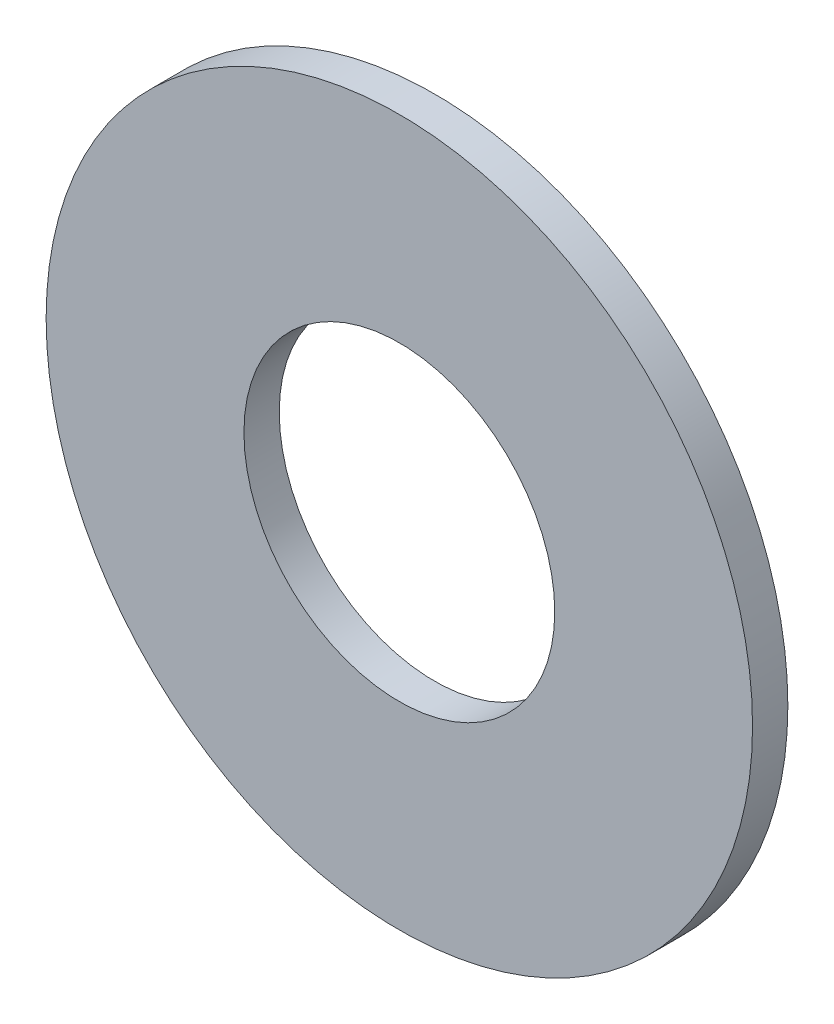
ISO-10303-21;
HEADER;
FILE_DESCRIPTION(('STEP AP214'),'2;1');
FILE_NAME('part.step','',(''),(''),'','','');
FILE_SCHEMA(('AUTOMOTIVE_DESIGN { 1 0 10303 214 1 1 1 1 }'));
ENDSEC;
DATA;
#1=APPLICATION_CONTEXT('core data for automotive mechanical design processes');
#2=APPLICATION_PROTOCOL_DEFINITION('international standard','automotive_design',2000,#1);
#3=PRODUCT_CONTEXT('',#1,'mechanical');
#4=PRODUCT('Part','Part','',(#3));
#5=PRODUCT_RELATED_PRODUCT_CATEGORY('part','',(#4));
#6=PRODUCT_DEFINITION_FORMATION('','',#4);
#7=PRODUCT_DEFINITION_CONTEXT('part definition',#1,'design');
#8=PRODUCT_DEFINITION('design','',#6,#7);
#9=PRODUCT_DEFINITION_SHAPE('','',#8);
#10=(LENGTH_UNIT() NAMED_UNIT(*) SI_UNIT(.MILLI.,.METRE.));
#11=(NAMED_UNIT(*) PLANE_ANGLE_UNIT() SI_UNIT($,.RADIAN.));
#12=(NAMED_UNIT(*) SI_UNIT($,.STERADIAN.) SOLID_ANGLE_UNIT());
#13=UNCERTAINTY_MEASURE_WITH_UNIT(LENGTH_MEASURE(1.E-05),#10,'distance_accuracy_value','');
#14=(GEOMETRIC_REPRESENTATION_CONTEXT(3) GLOBAL_UNCERTAINTY_ASSIGNED_CONTEXT((#13)) GLOBAL_UNIT_ASSIGNED_CONTEXT((#10,
#11,#12)) REPRESENTATION_CONTEXT('',''));
#15=CARTESIAN_POINT('',(0.,0.,0.));
#16=DIRECTION('',(0.,0.,1.));
#17=DIRECTION('',(1.,0.,0.));
#18=AXIS2_PLACEMENT_3D('',#15,#16,#17);
#19=CARTESIAN_POINT('',(0.,0.,-0.25));
#20=DIRECTION('',(0.,0.,1.));
#21=DIRECTION('',(1.,0.,0.));
#22=AXIS2_PLACEMENT_3D('',#19,#20,#21);
#23=CYLINDRICAL_SURFACE('',#22,2.5);
#24=CARTESIAN_POINT('',(0.,0.,-0.25));
#25=DIRECTION('',(0.,0.,1.));
#26=DIRECTION('',(1.,0.,0.));
#27=AXIS2_PLACEMENT_3D('',#24,#25,#26);
#28=CIRCLE('',#27,2.5);
#29=CARTESIAN_POINT('',(2.5,0.,-0.25));
#30=VERTEX_POINT('',#29);
#31=EDGE_CURVE('E10',#30,#30,#28,.T.);
#32=ORIENTED_EDGE('',*,*,#31,.T.);
#33=EDGE_LOOP('',(#32));
#34=FACE_BOUND('',#33,.T.);
#35=CARTESIAN_POINT('',(0.,0.,0.));
#36=DIRECTION('',(0.,0.,1.));
#37=DIRECTION('',(1.,0.,0.));
#38=AXIS2_PLACEMENT_3D('',#35,#36,#37);
#39=CIRCLE('',#38,2.5);
#40=CARTESIAN_POINT('',(2.5,0.,0.));
#41=VERTEX_POINT('',#40);
#42=EDGE_CURVE('E33',#41,#41,#39,.T.);
#43=ORIENTED_EDGE('',*,*,#42,.F.);
#44=EDGE_LOOP('',(#43));
#45=FACE_BOUND('',#44,.T.);
#46=ADVANCED_FACE('F30',(#34,#45),#23,.T.);
#47=CARTESIAN_POINT('',(0.,0.,-0.25));
#48=DIRECTION('',(0.,0.,1.));
#49=DIRECTION('',(1.,0.,0.));
#50=AXIS2_PLACEMENT_3D('',#47,#48,#49);
#51=PLANE('',#50);
#52=CARTESIAN_POINT('',(0.,0.,-0.25));
#53=DIRECTION('',(0.,0.,1.));
#54=DIRECTION('',(1.,0.,0.));
#55=AXIS2_PLACEMENT_3D('',#52,#53,#54);
#56=CIRCLE('',#55,1.1);
#57=CARTESIAN_POINT('',(1.1,0.,-0.25));
#58=VERTEX_POINT('',#57);
#59=EDGE_CURVE('E40',#58,#58,#56,.T.);
#60=ORIENTED_EDGE('',*,*,#59,.T.);
#61=EDGE_LOOP('',(#60));
#62=FACE_BOUND('',#61,.T.);
#63=ORIENTED_EDGE('',*,*,#31,.F.);
#64=EDGE_LOOP('',(#63));
#65=FACE_BOUND('',#64,.T.);
#66=ADVANCED_FACE('F48',(#62,#65),#51,.F.);
#67=CARTESIAN_POINT('',(0.,0.,0.));
#68=DIRECTION('',(0.,0.,1.));
#69=DIRECTION('',(1.,0.,0.));
#70=AXIS2_PLACEMENT_3D('',#67,#68,#69);
#71=PLANE('',#70);
#72=CARTESIAN_POINT('',(0.,0.,0.));
#73=DIRECTION('',(0.,0.,1.));
#74=DIRECTION('',(1.,0.,0.));
#75=AXIS2_PLACEMENT_3D('',#72,#73,#74);
#76=CIRCLE('',#75,1.1);
#77=CARTESIAN_POINT('',(1.1,0.,0.));
#78=VERTEX_POINT('',#77);
#79=EDGE_CURVE('E42',#78,#78,#76,.T.);
#80=ORIENTED_EDGE('',*,*,#79,.F.);
#81=EDGE_LOOP('',(#80));
#82=FACE_BOUND('',#81,.T.);
#83=ORIENTED_EDGE('',*,*,#42,.T.);
#84=EDGE_LOOP('',(#83));
#85=FACE_BOUND('',#84,.T.);
#86=ADVANCED_FACE('F54',(#82,#85),#71,.T.);
#87=CARTESIAN_POINT('',(0.,0.,-0.25));
#88=DIRECTION('',(0.,0.,1.));
#89=DIRECTION('',(1.,0.,0.));
#90=AXIS2_PLACEMENT_3D('',#87,#88,#89);
#91=CYLINDRICAL_SURFACE('',#90,1.1);
#92=ORIENTED_EDGE('',*,*,#59,.F.);
#93=EDGE_LOOP('',(#92));
#94=FACE_BOUND('',#93,.T.);
#95=ORIENTED_EDGE('',*,*,#79,.T.);
#96=EDGE_LOOP('',(#95));
#97=FACE_BOUND('',#96,.T.);
#98=ADVANCED_FACE('F51',(#94,#97),#91,.F.);
#99=CLOSED_SHELL('',(#46,#66,#86,#98));
#100=MANIFOLD_SOLID_BREP('B2',#99);
#101=ADVANCED_BREP_SHAPE_REPRESENTATION('',(#18,#100),#14);
#102=SHAPE_DEFINITION_REPRESENTATION(#9,#101);
ENDSEC;
END-ISO-10303-21;
